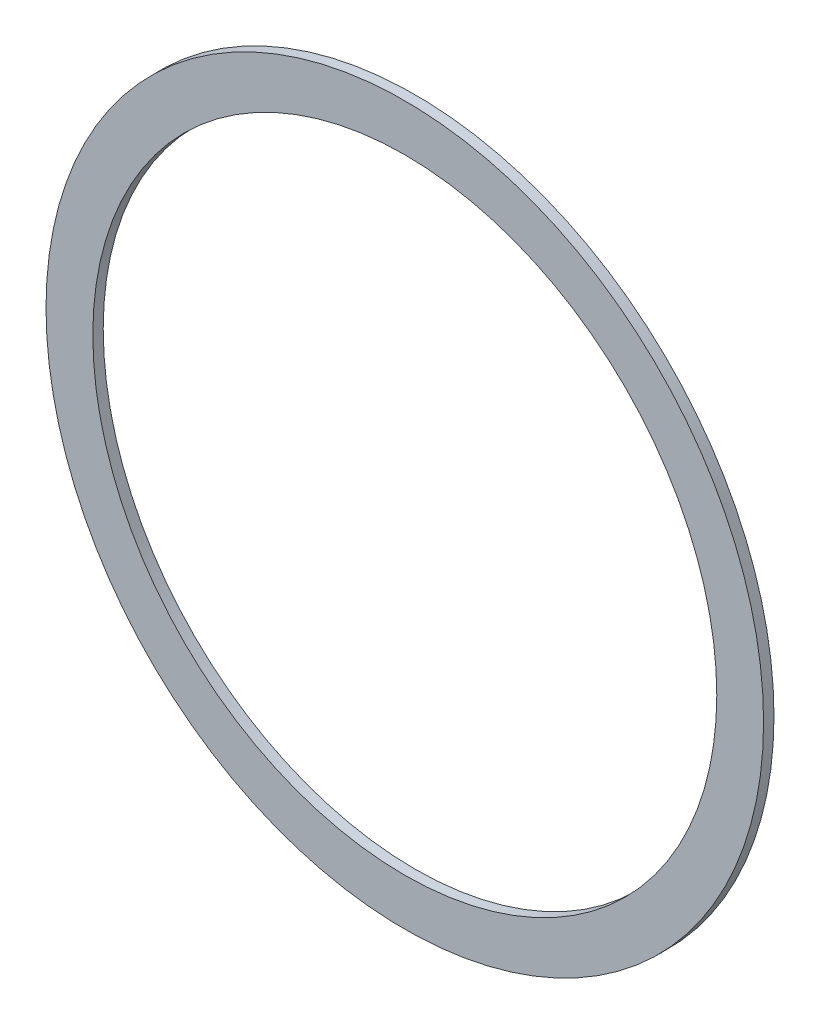
ISO-10303-21;
HEADER;
FILE_DESCRIPTION(('STEP AP214'),'2;1');
FILE_NAME('part.step','',(''),(''),'','','');
FILE_SCHEMA(('AUTOMOTIVE_DESIGN { 1 0 10303 214 1 1 1 1 }'));
ENDSEC;
DATA;
#1=APPLICATION_CONTEXT('core data for automotive mechanical design processes');
#2=APPLICATION_PROTOCOL_DEFINITION('international standard','automotive_design',2000,#1);
#3=PRODUCT_CONTEXT('',#1,'mechanical');
#4=PRODUCT('Part','Part','',(#3));
#5=PRODUCT_RELATED_PRODUCT_CATEGORY('part','',(#4));
#6=PRODUCT_DEFINITION_FORMATION('','',#4);
#7=PRODUCT_DEFINITION_CONTEXT('part definition',#1,'design');
#8=PRODUCT_DEFINITION('design','',#6,#7);
#9=PRODUCT_DEFINITION_SHAPE('','',#8);
#10=(LENGTH_UNIT() NAMED_UNIT(*) SI_UNIT(.MILLI.,.METRE.));
#11=(NAMED_UNIT(*) PLANE_ANGLE_UNIT() SI_UNIT($,.RADIAN.));
#12=(NAMED_UNIT(*) SI_UNIT($,.STERADIAN.) SOLID_ANGLE_UNIT());
#13=UNCERTAINTY_MEASURE_WITH_UNIT(LENGTH_MEASURE(1.E-05),#10,'distance_accuracy_value','');
#14=(GEOMETRIC_REPRESENTATION_CONTEXT(3) GLOBAL_UNCERTAINTY_ASSIGNED_CONTEXT((#13)) GLOBAL_UNIT_ASSIGNED_CONTEXT((#10,
#11,#12)) REPRESENTATION_CONTEXT('',''));
#15=CARTESIAN_POINT('',(0.,0.,0.));
#16=DIRECTION('',(0.,0.,1.));
#17=DIRECTION('',(1.,0.,0.));
#18=AXIS2_PLACEMENT_3D('',#15,#16,#17);
#19=CARTESIAN_POINT('',(0.,0.,1.));
#20=DIRECTION('',(0.,0.,1.));
#21=DIRECTION('',(1.,0.,0.));
#22=AXIS2_PLACEMENT_3D('',#19,#20,#21);
#23=PLANE('',#22);
#24=CARTESIAN_POINT('',(0.,0.,1.));
#25=DIRECTION('',(0.,0.,1.));
#26=DIRECTION('',(1.,0.,0.));
#27=AXIS2_PLACEMENT_3D('',#24,#25,#26);
#28=CIRCLE('',#27,69.);
#29=CARTESIAN_POINT('',(69.,0.,1.));
#30=VERTEX_POINT('',#29);
#31=EDGE_CURVE('E10',#30,#30,#28,.T.);
#32=ORIENTED_EDGE('',*,*,#31,.T.);
#33=EDGE_LOOP('',(#32));
#34=FACE_BOUND('',#33,.T.);
#35=CARTESIAN_POINT('',(0.,0.,1.));
#36=DIRECTION('',(0.,0.,1.));
#37=DIRECTION('',(1.,0.,0.));
#38=AXIS2_PLACEMENT_3D('',#35,#36,#37);
#39=CIRCLE('',#38,60.);
#40=CARTESIAN_POINT('',(60.,0.,1.));
#41=VERTEX_POINT('',#40);
#42=EDGE_CURVE('E53',#41,#41,#39,.T.);
#43=ORIENTED_EDGE('',*,*,#42,.F.);
#44=EDGE_LOOP('',(#43));
#45=FACE_BOUND('',#44,.T.);
#46=ADVANCED_FACE('F40',(#34,#45),#23,.T.);
#47=CARTESIAN_POINT('',(0.,0.,-1.));
#48=DIRECTION('',(0.,0.,1.));
#49=DIRECTION('',(1.,0.,0.));
#50=AXIS2_PLACEMENT_3D('',#47,#48,#49);
#51=PLANE('',#50);
#52=CARTESIAN_POINT('',(0.,0.,-1.));
#53=DIRECTION('',(0.,0.,1.));
#54=DIRECTION('',(1.,0.,0.));
#55=AXIS2_PLACEMENT_3D('',#52,#53,#54);
#56=CIRCLE('',#55,69.);
#57=CARTESIAN_POINT('',(69.,0.,-1.));
#58=VERTEX_POINT('',#57);
#59=EDGE_CURVE('E44',#58,#58,#56,.T.);
#60=ORIENTED_EDGE('',*,*,#59,.F.);
#61=EDGE_LOOP('',(#60));
#62=FACE_BOUND('',#61,.T.);
#63=CARTESIAN_POINT('',(0.,0.,-1.));
#64=DIRECTION('',(0.,0.,1.));
#65=DIRECTION('',(1.,0.,0.));
#66=AXIS2_PLACEMENT_3D('',#63,#64,#65);
#67=CIRCLE('',#66,60.);
#68=CARTESIAN_POINT('',(60.,0.,-1.));
#69=VERTEX_POINT('',#68);
#70=EDGE_CURVE('E55',#69,#69,#67,.T.);
#71=ORIENTED_EDGE('',*,*,#70,.T.);
#72=EDGE_LOOP('',(#71));
#73=FACE_BOUND('',#72,.T.);
#74=ADVANCED_FACE('F67',(#62,#73),#51,.F.);
#75=CARTESIAN_POINT('',(0.,0.,1.));
#76=DIRECTION('',(0.,0.,-1.));
#77=DIRECTION('',(-1.,0.,0.));
#78=AXIS2_PLACEMENT_3D('',#75,#76,#77);
#79=CYLINDRICAL_SURFACE('',#78,69.);
#80=ORIENTED_EDGE('',*,*,#31,.F.);
#81=EDGE_LOOP('',(#80));
#82=FACE_BOUND('',#81,.T.);
#83=ORIENTED_EDGE('',*,*,#59,.T.);
#84=EDGE_LOOP('',(#83));
#85=FACE_BOUND('',#84,.T.);
#86=ADVANCED_FACE('F42',(#82,#85),#79,.T.);
#87=CARTESIAN_POINT('',(0.,0.,1.));
#88=DIRECTION('',(0.,0.,-1.));
#89=DIRECTION('',(-1.,0.,0.));
#90=AXIS2_PLACEMENT_3D('',#87,#88,#89);
#91=CYLINDRICAL_SURFACE('',#90,60.);
#92=ORIENTED_EDGE('',*,*,#42,.T.);
#93=EDGE_LOOP('',(#92));
#94=FACE_BOUND('',#93,.T.);
#95=ORIENTED_EDGE('',*,*,#70,.F.);
#96=EDGE_LOOP('',(#95));
#97=FACE_BOUND('',#96,.T.);
#98=ADVANCED_FACE('F63',(#94,#97),#91,.F.);
#99=CLOSED_SHELL('',(#46,#74,#86,#98));
#100=MANIFOLD_SOLID_BREP('B2',#99);
#101=ADVANCED_BREP_SHAPE_REPRESENTATION('',(#18,#100),#14);
#102=SHAPE_DEFINITION_REPRESENTATION(#9,#101);
ENDSEC;
END-ISO-10303-21;
